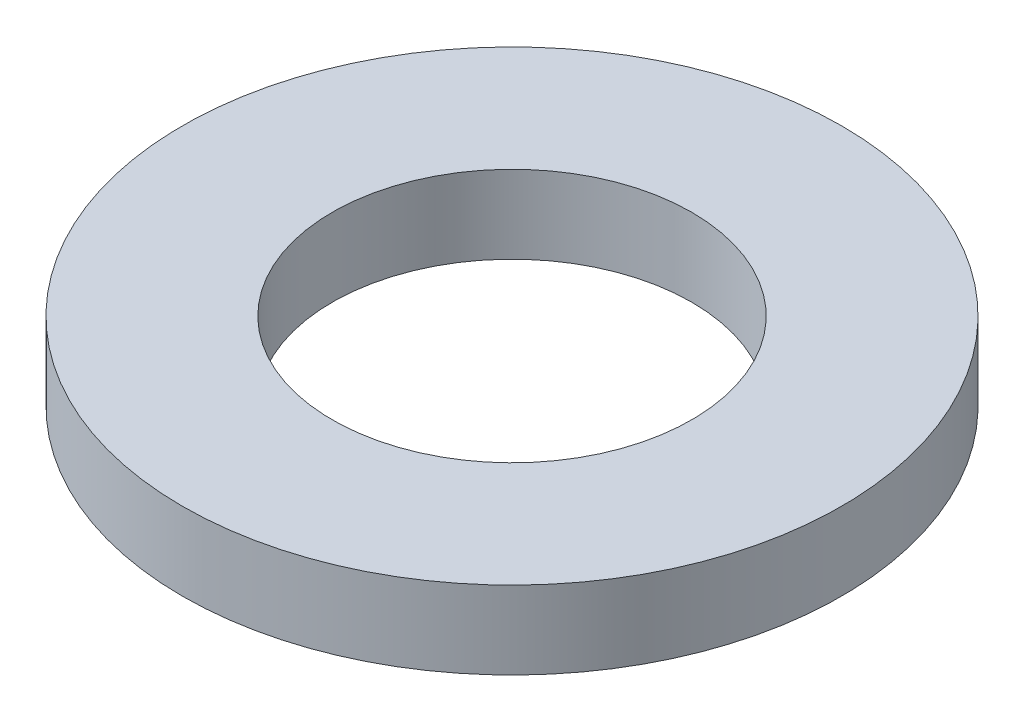
ISO-10303-21;
HEADER;
FILE_DESCRIPTION(('STEP AP214'),'2;1');
FILE_NAME('part.step','',(''),(''),'','','');
FILE_SCHEMA(('AUTOMOTIVE_DESIGN { 1 0 10303 214 1 1 1 1 }'));
ENDSEC;
DATA;
#1=APPLICATION_CONTEXT('core data for automotive mechanical design processes');
#2=APPLICATION_PROTOCOL_DEFINITION('international standard','automotive_design',2000,#1);
#3=PRODUCT_CONTEXT('',#1,'mechanical');
#4=PRODUCT('Part','Part','',(#3));
#5=PRODUCT_RELATED_PRODUCT_CATEGORY('part','',(#4));
#6=PRODUCT_DEFINITION_FORMATION('','',#4);
#7=PRODUCT_DEFINITION_CONTEXT('part definition',#1,'design');
#8=PRODUCT_DEFINITION('design','',#6,#7);
#9=PRODUCT_DEFINITION_SHAPE('','',#8);
#10=(LENGTH_UNIT() NAMED_UNIT(*) SI_UNIT(.MILLI.,.METRE.));
#11=(NAMED_UNIT(*) PLANE_ANGLE_UNIT() SI_UNIT($,.RADIAN.));
#12=(NAMED_UNIT(*) SI_UNIT($,.STERADIAN.) SOLID_ANGLE_UNIT());
#13=UNCERTAINTY_MEASURE_WITH_UNIT(LENGTH_MEASURE(1.E-05),#10,'distance_accuracy_value','');
#14=(GEOMETRIC_REPRESENTATION_CONTEXT(3) GLOBAL_UNCERTAINTY_ASSIGNED_CONTEXT((#13)) GLOBAL_UNIT_ASSIGNED_CONTEXT((#10,
#11,#12)) REPRESENTATION_CONTEXT('',''));
#15=CARTESIAN_POINT('',(0.,0.,0.));
#16=DIRECTION('',(0.,0.,1.));
#17=DIRECTION('',(1.,0.,0.));
#18=AXIS2_PLACEMENT_3D('',#15,#16,#17);
#19=CARTESIAN_POINT('',(0.,13.,0.));
#20=DIRECTION('',(0.,-1.,0.));
#21=DIRECTION('',(0.,0.,-1.));
#22=AXIS2_PLACEMENT_3D('',#19,#20,#21);
#23=CYLINDRICAL_SURFACE('',#22,55.);
#24=CARTESIAN_POINT('',(0.,13.,0.));
#25=DIRECTION('',(0.,1.,0.));
#26=DIRECTION('',(0.,0.,1.));
#27=AXIS2_PLACEMENT_3D('',#24,#25,#26);
#28=CIRCLE('',#27,55.);
#29=CARTESIAN_POINT('',(0.,13.,-55.));
#30=VERTEX_POINT('',#29);
#31=EDGE_CURVE('E10',#30,#30,#28,.T.);
#32=CARTESIAN_POINT('',(0.,0.,0.));
#33=DIRECTION('',(0.,1.,0.));
#34=DIRECTION('',(0.,0.,1.));
#35=AXIS2_PLACEMENT_3D('',#32,#33,#34);
#36=CIRCLE('',#35,55.);
#37=CARTESIAN_POINT('',(0.,0.,-55.));
#38=VERTEX_POINT('',#37);
#39=EDGE_CURVE('E37',#38,#38,#36,.T.);
#40=CARTESIAN_POINT('',(0.,13.,-55.));
#41=CARTESIAN_POINT('',(0.,12.8645833333333,-55.));
#42=CARTESIAN_POINT('',(0.,12.7291666666667,-55.));
#43=CARTESIAN_POINT('',(0.,12.4583333333333,-55.));
#44=CARTESIAN_POINT('',(0.,12.3229166666667,-55.));
#45=CARTESIAN_POINT('',(0.,12.0520833333333,-55.));
#46=CARTESIAN_POINT('',(0.,11.9166666666667,-55.));
#47=CARTESIAN_POINT('',(0.,11.6458333333333,-55.));
#48=CARTESIAN_POINT('',(0.,11.5104166666667,-55.));
#49=CARTESIAN_POINT('',(0.,11.2395833333333,-55.));
#50=CARTESIAN_POINT('',(0.,11.1041666666667,-55.));
#51=CARTESIAN_POINT('',(0.,10.8333333333333,-55.));
#52=CARTESIAN_POINT('',(0.,10.6979166666667,-55.));
#53=CARTESIAN_POINT('',(0.,10.4270833333333,-55.));
#54=CARTESIAN_POINT('',(0.,10.2916666666667,-55.));
#55=CARTESIAN_POINT('',(0.,10.0208333333333,-55.));
#56=CARTESIAN_POINT('',(0.,9.88541666666667,-55.));
#57=CARTESIAN_POINT('',(0.,9.61458333333333,-55.));
#58=CARTESIAN_POINT('',(0.,9.47916666666667,-55.));
#59=CARTESIAN_POINT('',(0.,9.20833333333333,-55.));
#60=CARTESIAN_POINT('',(0.,9.07291666666667,-55.));
#61=CARTESIAN_POINT('',(0.,8.80208333333333,-55.));
#62=CARTESIAN_POINT('',(0.,8.66666666666667,-55.));
#63=CARTESIAN_POINT('',(0.,8.39583333333333,-55.));
#64=CARTESIAN_POINT('',(0.,8.26041666666667,-55.));
#65=CARTESIAN_POINT('',(0.,7.98958333333333,-55.));
#66=CARTESIAN_POINT('',(0.,7.85416666666667,-55.));
#67=CARTESIAN_POINT('',(0.,7.58333333333333,-55.));
#68=CARTESIAN_POINT('',(0.,7.44791666666667,-55.));
#69=CARTESIAN_POINT('',(0.,7.17708333333333,-55.));
#70=CARTESIAN_POINT('',(0.,7.04166666666667,-55.));
#71=CARTESIAN_POINT('',(0.,6.77083333333333,-55.));
#72=CARTESIAN_POINT('',(0.,6.63541666666667,-55.));
#73=CARTESIAN_POINT('',(0.,6.36458333333333,-55.));
#74=CARTESIAN_POINT('',(0.,6.22916666666667,-55.));
#75=CARTESIAN_POINT('',(0.,5.95833333333333,-55.));
#76=CARTESIAN_POINT('',(0.,5.82291666666667,-55.));
#77=CARTESIAN_POINT('',(0.,5.55208333333333,-55.));
#78=CARTESIAN_POINT('',(0.,5.41666666666667,-55.));
#79=CARTESIAN_POINT('',(0.,5.14583333333333,-55.));
#80=CARTESIAN_POINT('',(0.,5.01041666666667,-55.));
#81=CARTESIAN_POINT('',(0.,4.73958333333333,-55.));
#82=CARTESIAN_POINT('',(0.,4.60416666666667,-55.));
#83=CARTESIAN_POINT('',(0.,4.33333333333333,-55.));
#84=CARTESIAN_POINT('',(0.,4.19791666666667,-55.));
#85=CARTESIAN_POINT('',(0.,3.92708333333333,-55.));
#86=CARTESIAN_POINT('',(0.,3.79166666666667,-55.));
#87=CARTESIAN_POINT('',(0.,3.52083333333333,-55.));
#88=CARTESIAN_POINT('',(0.,3.38541666666667,-55.));
#89=CARTESIAN_POINT('',(0.,3.11458333333333,-55.));
#90=CARTESIAN_POINT('',(0.,2.97916666666667,-55.));
#91=CARTESIAN_POINT('',(0.,2.70833333333333,-55.));
#92=CARTESIAN_POINT('',(0.,2.57291666666667,-55.));
#93=CARTESIAN_POINT('',(0.,2.30208333333333,-55.));
#94=CARTESIAN_POINT('',(0.,2.16666666666667,-55.));
#95=CARTESIAN_POINT('',(0.,1.89583333333333,-55.));
#96=CARTESIAN_POINT('',(0.,1.76041666666667,-55.));
#97=CARTESIAN_POINT('',(0.,1.48958333333333,-55.));
#98=CARTESIAN_POINT('',(0.,1.35416666666667,-55.));
#99=CARTESIAN_POINT('',(0.,1.08333333333333,-55.));
#100=CARTESIAN_POINT('',(0.,0.947916666666667,-55.));
#101=CARTESIAN_POINT('',(0.,0.677083333333334,-55.));
#102=CARTESIAN_POINT('',(0.,0.541666666666667,-55.));
#103=CARTESIAN_POINT('',(0.,0.270833333333334,-55.));
#104=CARTESIAN_POINT('',(0.,0.135416666666667,-55.));
#105=CARTESIAN_POINT('',(0.,0.,-55.));
#106=B_SPLINE_CURVE_WITH_KNOTS('',3,(#40,#41,#42,#43,#44,#45,#46,#47,#48,#49,#50,#51,#52,#53,
#54,#55,#56,#57,#58,#59,#60,#61,#62,#63,#64,#65,#66,#67,#68,#69,#70,#71,#72,#73,#74,#75,#76,#77,
#78,#79,#80,#81,#82,#83,#84,#85,#86,#87,#88,#89,#90,#91,#92,#93,#94,#95,#96,#97,#98,#99,#100,
#101,#102,#103,#104,#105),.UNSPECIFIED.,.F.,.F.,(4,2,2,2,2,2,2,2,2,2,2,2,2,2,2,2,2,2,2,2,2,2,2,
2,2,2,2,2,2,2,2,2,4),(0.,0.406249999999999,0.812499999999999,1.21875,1.625,2.03125,2.4375,
2.84375,3.25,3.65625,4.0625,4.46875,4.875,5.28125,5.6875,6.09375,6.5,6.90625,7.3125,7.71875,
8.125,8.53125,8.9375,9.34375,9.75,10.15625,10.5625,10.96875,11.375,11.78125,12.1875,12.59375,
13.),.UNSPECIFIED.);
#107=EDGE_CURVE('BSEAM40',#30,#38,#106,.T.);
#108=ORIENTED_EDGE('',*,*,#31,.F.);
#109=ORIENTED_EDGE('',*,*,#39,.T.);
#110=ORIENTED_EDGE('',*,*,#107,.T.);
#111=ORIENTED_EDGE('',*,*,#107,.F.);
#112=EDGE_LOOP('',(#108,#110,#109,#111));
#113=FACE_BOUND('',#112,.T.);
#114=ADVANCED_FACE('F40',(#113),#23,.T.);
#115=CARTESIAN_POINT('',(0.,13.,0.));
#116=DIRECTION('',(0.,1.,0.));
#117=DIRECTION('',(0.,0.,1.));
#118=AXIS2_PLACEMENT_3D('',#115,#116,#117);
#119=PLANE('',#118);
#120=CARTESIAN_POINT('',(0.,13.,0.));
#121=DIRECTION('',(0.,1.,0.));
#122=DIRECTION('',(0.,0.,1.));
#123=AXIS2_PLACEMENT_3D('',#120,#121,#122);
#124=CIRCLE('',#123,30.);
#125=CARTESIAN_POINT('',(0.,13.,-30.));
#126=VERTEX_POINT('',#125);
#127=EDGE_CURVE('E50',#126,#126,#124,.T.);
#128=ORIENTED_EDGE('',*,*,#127,.F.);
#129=EDGE_LOOP('',(#128));
#130=FACE_BOUND('',#129,.T.);
#131=ORIENTED_EDGE('',*,*,#31,.T.);
#132=EDGE_LOOP('',(#131));
#133=FACE_BOUND('',#132,.T.);
#134=ADVANCED_FACE('F59',(#130,#133),#119,.T.);
#135=CARTESIAN_POINT('',(0.,0.,0.));
#136=DIRECTION('',(0.,1.,0.));
#137=DIRECTION('',(0.,0.,1.));
#138=AXIS2_PLACEMENT_3D('',#135,#136,#137);
#139=PLANE('',#138);
#140=CARTESIAN_POINT('',(0.,0.,0.));
#141=DIRECTION('',(0.,1.,0.));
#142=DIRECTION('',(0.,0.,1.));
#143=AXIS2_PLACEMENT_3D('',#140,#141,#142);
#144=CIRCLE('',#143,30.);
#145=CARTESIAN_POINT('',(0.,0.,-30.));
#146=VERTEX_POINT('',#145);
#147=EDGE_CURVE('E47',#146,#146,#144,.T.);
#148=ORIENTED_EDGE('',*,*,#147,.T.);
#149=EDGE_LOOP('',(#148));
#150=FACE_BOUND('',#149,.T.);
#151=ORIENTED_EDGE('',*,*,#39,.F.);
#152=EDGE_LOOP('',(#151));
#153=FACE_BOUND('',#152,.T.);
#154=ADVANCED_FACE('F58',(#150,#153),#139,.F.);
#155=CARTESIAN_POINT('',(0.,13.,0.));
#156=DIRECTION('',(0.,-1.,0.));
#157=DIRECTION('',(0.,0.,-1.));
#158=AXIS2_PLACEMENT_3D('',#155,#156,#157);
#159=CYLINDRICAL_SURFACE('',#158,30.);
#160=CARTESIAN_POINT('',(0.,13.,-30.));
#161=CARTESIAN_POINT('',(0.,12.8645833333333,-30.));
#162=CARTESIAN_POINT('',(0.,12.7291666666667,-30.));
#163=CARTESIAN_POINT('',(0.,12.4583333333333,-30.));
#164=CARTESIAN_POINT('',(0.,12.3229166666667,-30.));
#165=CARTESIAN_POINT('',(0.,12.0520833333333,-30.));
#166=CARTESIAN_POINT('',(0.,11.9166666666667,-30.));
#167=CARTESIAN_POINT('',(0.,11.6458333333333,-30.));
#168=CARTESIAN_POINT('',(0.,11.5104166666667,-30.));
#169=CARTESIAN_POINT('',(0.,11.2395833333333,-30.));
#170=CARTESIAN_POINT('',(0.,11.1041666666667,-30.));
#171=CARTESIAN_POINT('',(0.,10.8333333333333,-30.));
#172=CARTESIAN_POINT('',(0.,10.6979166666667,-30.));
#173=CARTESIAN_POINT('',(0.,10.4270833333333,-30.));
#174=CARTESIAN_POINT('',(0.,10.2916666666667,-30.));
#175=CARTESIAN_POINT('',(0.,10.0208333333333,-30.));
#176=CARTESIAN_POINT('',(0.,9.88541666666667,-30.));
#177=CARTESIAN_POINT('',(0.,9.61458333333333,-30.));
#178=CARTESIAN_POINT('',(0.,9.47916666666667,-30.));
#179=CARTESIAN_POINT('',(0.,9.20833333333333,-30.));
#180=CARTESIAN_POINT('',(0.,9.07291666666667,-30.));
#181=CARTESIAN_POINT('',(0.,8.80208333333333,-30.));
#182=CARTESIAN_POINT('',(0.,8.66666666666667,-30.));
#183=CARTESIAN_POINT('',(0.,8.39583333333333,-30.));
#184=CARTESIAN_POINT('',(0.,8.26041666666667,-30.));
#185=CARTESIAN_POINT('',(0.,7.98958333333333,-30.));
#186=CARTESIAN_POINT('',(0.,7.85416666666667,-30.));
#187=CARTESIAN_POINT('',(0.,7.58333333333333,-30.));
#188=CARTESIAN_POINT('',(0.,7.44791666666667,-30.));
#189=CARTESIAN_POINT('',(0.,7.17708333333333,-30.));
#190=CARTESIAN_POINT('',(0.,7.04166666666667,-30.));
#191=CARTESIAN_POINT('',(0.,6.77083333333333,-30.));
#192=CARTESIAN_POINT('',(0.,6.63541666666667,-30.));
#193=CARTESIAN_POINT('',(0.,6.36458333333333,-30.));
#194=CARTESIAN_POINT('',(0.,6.22916666666667,-30.));
#195=CARTESIAN_POINT('',(0.,5.95833333333333,-30.));
#196=CARTESIAN_POINT('',(0.,5.82291666666667,-30.));
#197=CARTESIAN_POINT('',(0.,5.55208333333333,-30.));
#198=CARTESIAN_POINT('',(0.,5.41666666666667,-30.));
#199=CARTESIAN_POINT('',(0.,5.14583333333333,-30.));
#200=CARTESIAN_POINT('',(0.,5.01041666666667,-30.));
#201=CARTESIAN_POINT('',(0.,4.73958333333333,-30.));
#202=CARTESIAN_POINT('',(0.,4.60416666666667,-30.));
#203=CARTESIAN_POINT('',(0.,4.33333333333333,-30.));
#204=CARTESIAN_POINT('',(0.,4.19791666666667,-30.));
#205=CARTESIAN_POINT('',(0.,3.92708333333333,-30.));
#206=CARTESIAN_POINT('',(0.,3.79166666666667,-30.));
#207=CARTESIAN_POINT('',(0.,3.52083333333333,-30.));
#208=CARTESIAN_POINT('',(0.,3.38541666666667,-30.));
#209=CARTESIAN_POINT('',(0.,3.11458333333333,-30.));
#210=CARTESIAN_POINT('',(0.,2.97916666666667,-30.));
#211=CARTESIAN_POINT('',(0.,2.70833333333333,-30.));
#212=CARTESIAN_POINT('',(0.,2.57291666666667,-30.));
#213=CARTESIAN_POINT('',(0.,2.30208333333333,-30.));
#214=CARTESIAN_POINT('',(0.,2.16666666666667,-30.));
#215=CARTESIAN_POINT('',(0.,1.89583333333333,-30.));
#216=CARTESIAN_POINT('',(0.,1.76041666666667,-30.));
#217=CARTESIAN_POINT('',(0.,1.48958333333333,-30.));
#218=CARTESIAN_POINT('',(0.,1.35416666666667,-30.));
#219=CARTESIAN_POINT('',(0.,1.08333333333333,-30.));
#220=CARTESIAN_POINT('',(0.,0.947916666666667,-30.));
#221=CARTESIAN_POINT('',(0.,0.677083333333334,-30.));
#222=CARTESIAN_POINT('',(0.,0.541666666666667,-30.));
#223=CARTESIAN_POINT('',(0.,0.270833333333334,-30.));
#224=CARTESIAN_POINT('',(0.,0.135416666666667,-30.));
#225=CARTESIAN_POINT('',(0.,0.,-30.));
#226=B_SPLINE_CURVE_WITH_KNOTS('',3,(#160,#161,#162,#163,#164,#165,#166,#167,#168,#169,#170,
#171,#172,#173,#174,#175,#176,#177,#178,#179,#180,#181,#182,#183,#184,#185,#186,#187,#188,#189,
#190,#191,#192,#193,#194,#195,#196,#197,#198,#199,#200,#201,#202,#203,#204,#205,#206,#207,#208,
#209,#210,#211,#212,#213,#214,#215,#216,#217,#218,#219,#220,#221,#222,#223,#224,#225),
.UNSPECIFIED.,.F.,.F.,(4,2,2,2,2,2,2,2,2,2,2,2,2,2,2,2,2,2,2,2,2,2,2,2,2,2,2,2,2,2,2,2,4),(0.,
0.406249999999999,0.812499999999999,1.21875,1.625,2.03125,2.4375,2.84375,3.25,3.65625,4.0625,
4.46875,4.875,5.28125,5.6875,6.09375,6.5,6.90625,7.3125,7.71875,8.125,8.53125,8.9375,9.34375,
9.75,10.15625,10.5625,10.96875,11.375,11.78125,12.1875,12.59375,13.),.UNSPECIFIED.);
#227=EDGE_CURVE('BSEAM54',#126,#146,#226,.T.);
#228=ORIENTED_EDGE('',*,*,#127,.T.);
#229=ORIENTED_EDGE('',*,*,#147,.F.);
#230=ORIENTED_EDGE('',*,*,#227,.T.);
#231=ORIENTED_EDGE('',*,*,#227,.F.);
#232=EDGE_LOOP('',(#228,#230,#229,#231));
#233=FACE_BOUND('',#232,.T.);
#234=ADVANCED_FACE('F54',(#233),#159,.F.);
#235=CLOSED_SHELL('',(#114,#134,#154,#234));
#236=MANIFOLD_SOLID_BREP('B2',#235);
#237=ADVANCED_BREP_SHAPE_REPRESENTATION('',(#18,#236),#14);
#238=SHAPE_DEFINITION_REPRESENTATION(#9,#237);
ENDSEC;
END-ISO-10303-21;
